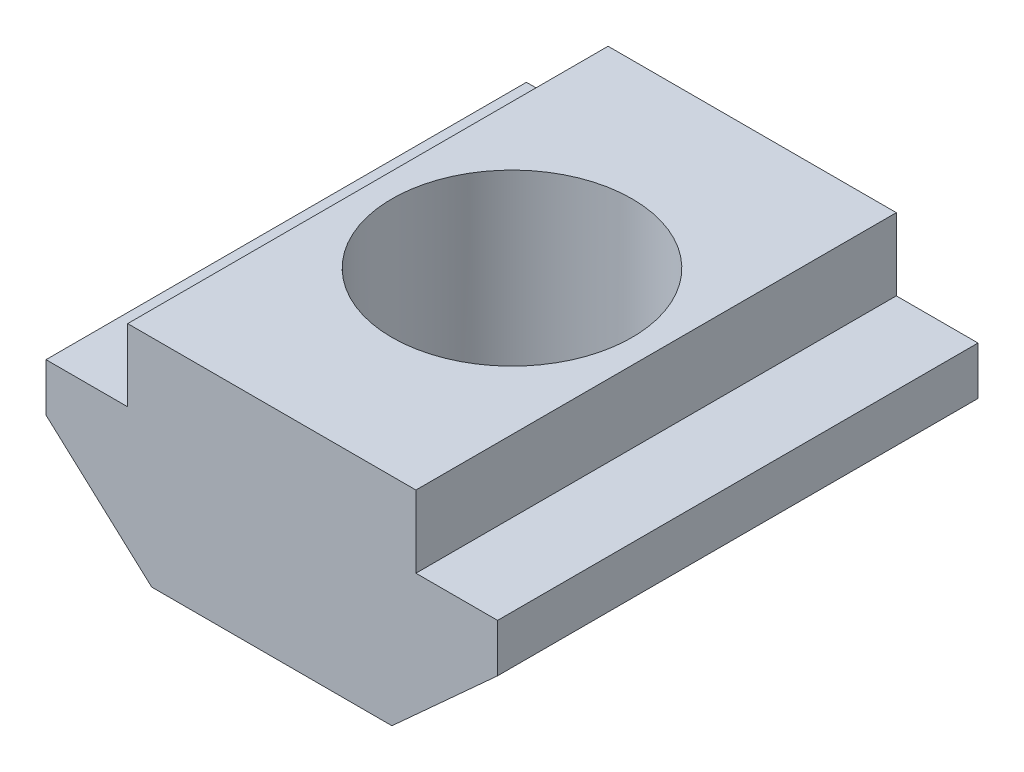
ISO-10303-21;
HEADER;
FILE_DESCRIPTION(('STEP AP214'),'2;1');
FILE_NAME('part.step','',(''),(''),'','','');
FILE_SCHEMA(('AUTOMOTIVE_DESIGN { 1 0 10303 214 1 1 1 1 }'));
ENDSEC;
DATA;
#1=APPLICATION_CONTEXT('core data for automotive mechanical design processes');
#2=APPLICATION_PROTOCOL_DEFINITION('international standard','automotive_design',2000,#1);
#3=PRODUCT_CONTEXT('',#1,'mechanical');
#4=PRODUCT('Part','Part','',(#3));
#5=PRODUCT_RELATED_PRODUCT_CATEGORY('part','',(#4));
#6=PRODUCT_DEFINITION_FORMATION('','',#4);
#7=PRODUCT_DEFINITION_CONTEXT('part definition',#1,'design');
#8=PRODUCT_DEFINITION('design','',#6,#7);
#9=PRODUCT_DEFINITION_SHAPE('','',#8);
#10=(LENGTH_UNIT() NAMED_UNIT(*) SI_UNIT(.MILLI.,.METRE.));
#11=(NAMED_UNIT(*) PLANE_ANGLE_UNIT() SI_UNIT($,.RADIAN.));
#12=(NAMED_UNIT(*) SI_UNIT($,.STERADIAN.) SOLID_ANGLE_UNIT());
#13=UNCERTAINTY_MEASURE_WITH_UNIT(LENGTH_MEASURE(1.E-05),#10,'distance_accuracy_value','');
#14=(GEOMETRIC_REPRESENTATION_CONTEXT(3) GLOBAL_UNCERTAINTY_ASSIGNED_CONTEXT((#13)) GLOBAL_UNIT_ASSIGNED_CONTEXT((#10,
#11,#12)) REPRESENTATION_CONTEXT('',''));
#15=CARTESIAN_POINT('',(0.,0.,0.));
#16=DIRECTION('',(0.,0.,1.));
#17=DIRECTION('',(1.,0.,0.));
#18=AXIS2_PLACEMENT_3D('',#15,#16,#17);
#19=CARTESIAN_POINT('',(-2.5,-4.5,5.));
#20=DIRECTION('',(0.,1.,0.));
#21=DIRECTION('',(0.,0.,1.));
#22=AXIS2_PLACEMENT_3D('',#19,#20,#21);
#23=PLANE('',#22);
#24=DIRECTION('',(0.,0.,-1.));
#25=VECTOR('',#24,1.);
#26=CARTESIAN_POINT('',(2.5,-4.5,5.));
#27=LINE('',#26,#25);
#28=CARTESIAN_POINT('',(2.5,-4.5,0.));
#29=VERTEX_POINT('',#28);
#30=CARTESIAN_POINT('',(2.5,-4.5,-5.));
#31=VERTEX_POINT('',#30);
#32=EDGE_CURVE('E205',#29,#31,#27,.T.);
#33=ORIENTED_EDGE('',*,*,#32,.F.);
#34=CARTESIAN_POINT('',(0.,-4.5,0.));
#35=DIRECTION('',(0.,1.,0.));
#36=DIRECTION('',(0.,0.,1.));
#37=AXIS2_PLACEMENT_3D('',#34,#35,#36);
#38=CIRCLE('',#37,2.5);
#39=CARTESIAN_POINT('',(-2.5,-4.5,0.));
#40=VERTEX_POINT('',#39);
#41=EDGE_CURVE('E53',#29,#40,#38,.T.);
#42=ORIENTED_EDGE('',*,*,#41,.T.);
#43=DIRECTION('',(0.,0.,-1.));
#44=VECTOR('',#43,1.);
#45=CARTESIAN_POINT('',(-2.5,-4.5,5.));
#46=LINE('',#45,#44);
#47=CARTESIAN_POINT('',(-2.5,-4.5,-5.));
#48=VERTEX_POINT('',#47);
#49=EDGE_CURVE('E210',#40,#48,#46,.T.);
#50=ORIENTED_EDGE('',*,*,#49,.T.);
#51=DIRECTION('',(1.,0.,0.));
#52=VECTOR('',#51,1.);
#53=CARTESIAN_POINT('',(-2.5,-4.5,-5.));
#54=LINE('',#53,#52);
#55=EDGE_CURVE('E177',#48,#31,#54,.T.);
#56=ORIENTED_EDGE('',*,*,#55,.T.);
#57=EDGE_LOOP('',(#33,#42,#50,#56));
#58=FACE_BOUND('',#57,.T.);
#59=ADVANCED_FACE('F38',(#58),#23,.F.);
#60=CARTESIAN_POINT('',(-3.,0.,5.));
#61=DIRECTION('',(1.,0.,0.));
#62=DIRECTION('',(0.,1.,0.));
#63=AXIS2_PLACEMENT_3D('',#60,#61,#62);
#64=PLANE('',#63);
#65=DIRECTION('',(0.,-1.,0.));
#66=VECTOR('',#65,1.);
#67=CARTESIAN_POINT('',(-3.,0.,-5.));
#68=LINE('',#67,#66);
#69=CARTESIAN_POINT('',(-3.,0.,-5.));
#70=VERTEX_POINT('',#69);
#71=CARTESIAN_POINT('',(-3.,-1.5,-5.));
#72=VERTEX_POINT('',#71);
#73=EDGE_CURVE('E163',#70,#72,#68,.T.);
#74=ORIENTED_EDGE('',*,*,#73,.T.);
#75=DIRECTION('',(0.,0.,-1.));
#76=VECTOR('',#75,1.);
#77=CARTESIAN_POINT('',(-3.,-1.5,5.));
#78=LINE('',#77,#76);
#79=CARTESIAN_POINT('',(-3.,-1.5,5.));
#80=VERTEX_POINT('',#79);
#81=EDGE_CURVE('E11',#80,#72,#78,.T.);
#82=ORIENTED_EDGE('',*,*,#81,.F.);
#83=DIRECTION('',(0.,-1.,0.));
#84=VECTOR('',#83,1.);
#85=CARTESIAN_POINT('',(-3.,0.,5.));
#86=LINE('',#85,#84);
#87=CARTESIAN_POINT('',(-3.,0.,5.));
#88=VERTEX_POINT('',#87);
#89=EDGE_CURVE('E194',#88,#80,#86,.T.);
#90=ORIENTED_EDGE('',*,*,#89,.F.);
#91=DIRECTION('',(0.,0.,-1.));
#92=VECTOR('',#91,1.);
#93=CARTESIAN_POINT('',(-3.,0.,5.));
#94=LINE('',#93,#92);
#95=EDGE_CURVE('E159',#88,#70,#94,.T.);
#96=ORIENTED_EDGE('',*,*,#95,.T.);
#97=EDGE_LOOP('',(#74,#82,#90,#96));
#98=FACE_BOUND('',#97,.T.);
#99=ADVANCED_FACE('F40',(#98),#64,.F.);
#100=CARTESIAN_POINT('',(-3.,-1.5,5.));
#101=DIRECTION('',(0.,-1.,0.));
#102=DIRECTION('',(1.,0.,0.));
#103=AXIS2_PLACEMENT_3D('',#100,#101,#102);
#104=PLANE('',#103);
#105=DIRECTION('',(-1.,0.,0.));
#106=VECTOR('',#105,1.);
#107=CARTESIAN_POINT('',(-3.,-1.5,-5.));
#108=LINE('',#107,#106);
#109=CARTESIAN_POINT('',(-4.7,-1.5,-5.));
#110=VERTEX_POINT('',#109);
#111=EDGE_CURVE('E167',#72,#110,#108,.T.);
#112=ORIENTED_EDGE('',*,*,#111,.T.);
#113=DIRECTION('',(0.,0.,-1.));
#114=VECTOR('',#113,1.);
#115=CARTESIAN_POINT('',(-4.7,-1.5,5.));
#116=LINE('',#115,#114);
#117=CARTESIAN_POINT('',(-4.7,-1.5,5.));
#118=VERTEX_POINT('',#117);
#119=EDGE_CURVE('E47',#118,#110,#116,.T.);
#120=ORIENTED_EDGE('',*,*,#119,.F.);
#121=DIRECTION('',(-1.,0.,0.));
#122=VECTOR('',#121,1.);
#123=CARTESIAN_POINT('',(-3.,-1.5,5.));
#124=LINE('',#123,#122);
#125=EDGE_CURVE('E109',#80,#118,#124,.T.);
#126=ORIENTED_EDGE('',*,*,#125,.F.);
#127=ORIENTED_EDGE('',*,*,#81,.T.);
#128=EDGE_LOOP('',(#112,#120,#126,#127));
#129=FACE_BOUND('',#128,.T.);
#130=ADVANCED_FACE('F279',(#129),#104,.F.);
#131=CARTESIAN_POINT('',(-4.7,-1.5,5.));
#132=DIRECTION('',(1.,0.,0.));
#133=DIRECTION('',(0.,1.,0.));
#134=AXIS2_PLACEMENT_3D('',#131,#132,#133);
#135=PLANE('',#134);
#136=DIRECTION('',(0.,-1.,0.));
#137=VECTOR('',#136,1.);
#138=CARTESIAN_POINT('',(-4.7,-1.5,-5.));
#139=LINE('',#138,#137);
#140=CARTESIAN_POINT('',(-4.7,-2.5,-5.));
#141=VERTEX_POINT('',#140);
#142=EDGE_CURVE('E170',#110,#141,#139,.T.);
#143=ORIENTED_EDGE('',*,*,#142,.T.);
#144=DIRECTION('',(0.,0.,-1.));
#145=VECTOR('',#144,1.);
#146=CARTESIAN_POINT('',(-4.7,-2.5,5.));
#147=LINE('',#146,#145);
#148=CARTESIAN_POINT('',(-4.7,-2.5,5.));
#149=VERTEX_POINT('',#148);
#150=EDGE_CURVE('E215',#149,#141,#147,.T.);
#151=ORIENTED_EDGE('',*,*,#150,.F.);
#152=DIRECTION('',(0.,-1.,0.));
#153=VECTOR('',#152,1.);
#154=CARTESIAN_POINT('',(-4.7,-1.5,5.));
#155=LINE('',#154,#153);
#156=EDGE_CURVE('E225',#118,#149,#155,.T.);
#157=ORIENTED_EDGE('',*,*,#156,.F.);
#158=ORIENTED_EDGE('',*,*,#119,.T.);
#159=EDGE_LOOP('',(#143,#151,#157,#158));
#160=FACE_BOUND('',#159,.T.);
#161=ADVANCED_FACE('F223',(#160),#135,.F.);
#162=CARTESIAN_POINT('',(-4.7,-2.5,5.));
#163=DIRECTION('',(0.672672793996312,0.739940073395944,0.));
#164=DIRECTION('',(-0.739940073395944,0.672672793996312,0.));
#165=AXIS2_PLACEMENT_3D('',#162,#163,#164);
#166=PLANE('',#165);
#167=DIRECTION('',(0.739940073395944,-0.672672793996312,0.));
#168=VECTOR('',#167,1.);
#169=CARTESIAN_POINT('',(-4.7,-2.5,-5.));
#170=LINE('',#169,#168);
#171=EDGE_CURVE('E173',#141,#48,#170,.T.);
#172=ORIENTED_EDGE('',*,*,#171,.T.);
#173=ORIENTED_EDGE('',*,*,#49,.F.);
#174=CARTESIAN_POINT('',(-2.5,-4.5,5.));
#175=VERTEX_POINT('',#174);
#176=EDGE_CURVE('E211',#175,#40,#46,.T.);
#177=ORIENTED_EDGE('',*,*,#176,.F.);
#178=DIRECTION('',(0.739940073395944,-0.672672793996312,0.));
#179=VECTOR('',#178,1.);
#180=CARTESIAN_POINT('',(-4.7,-2.5,5.));
#181=LINE('',#180,#179);
#182=EDGE_CURVE('E237',#149,#175,#181,.T.);
#183=ORIENTED_EDGE('',*,*,#182,.F.);
#184=ORIENTED_EDGE('',*,*,#150,.T.);
#185=EDGE_LOOP('',(#172,#173,#177,#183,#184));
#186=FACE_BOUND('',#185,.T.);
#187=ADVANCED_FACE('F234',(#186),#166,.F.);
#188=ORIENTED_EDGE('',*,*,#176,.T.);
#189=EDGE_CURVE('E250',#40,#29,#38,.T.);
#190=ORIENTED_EDGE('',*,*,#189,.T.);
#191=CARTESIAN_POINT('',(2.5,-4.5,5.));
#192=VERTEX_POINT('',#191);
#193=EDGE_CURVE('E206',#192,#29,#27,.T.);
#194=ORIENTED_EDGE('',*,*,#193,.F.);
#195=DIRECTION('',(1.,0.,0.));
#196=VECTOR('',#195,1.);
#197=CARTESIAN_POINT('',(-2.5,-4.5,5.));
#198=LINE('',#197,#196);
#199=EDGE_CURVE('E239',#175,#192,#198,.T.);
#200=ORIENTED_EDGE('',*,*,#199,.F.);
#201=EDGE_LOOP('',(#188,#190,#194,#200));
#202=FACE_BOUND('',#201,.T.);
#203=ADVANCED_FACE('F267',(#202),#23,.F.);
#204=CARTESIAN_POINT('',(4.7,-2.5,5.));
#205=DIRECTION('',(-0.672672793996312,0.739940073395944,0.));
#206=DIRECTION('',(-0.739940073395944,-0.672672793996312,0.));
#207=AXIS2_PLACEMENT_3D('',#204,#205,#206);
#208=PLANE('',#207);
#209=DIRECTION('',(0.739940073395944,0.672672793996312,0.));
#210=VECTOR('',#209,1.);
#211=CARTESIAN_POINT('',(4.7,-2.5,-5.));
#212=LINE('',#211,#210);
#213=CARTESIAN_POINT('',(4.7,-2.5,-5.));
#214=VERTEX_POINT('',#213);
#215=EDGE_CURVE('E181',#31,#214,#212,.T.);
#216=ORIENTED_EDGE('',*,*,#215,.T.);
#217=DIRECTION('',(0.,0.,-1.));
#218=VECTOR('',#217,1.);
#219=CARTESIAN_POINT('',(4.7,-2.5,5.));
#220=LINE('',#219,#218);
#221=CARTESIAN_POINT('',(4.7,-2.5,5.));
#222=VERTEX_POINT('',#221);
#223=EDGE_CURVE('E201',#222,#214,#220,.T.);
#224=ORIENTED_EDGE('',*,*,#223,.F.);
#225=DIRECTION('',(0.739940073395944,0.672672793996312,0.));
#226=VECTOR('',#225,1.);
#227=CARTESIAN_POINT('',(4.7,-2.5,5.));
#228=LINE('',#227,#226);
#229=EDGE_CURVE('E242',#192,#222,#228,.T.);
#230=ORIENTED_EDGE('',*,*,#229,.F.);
#231=ORIENTED_EDGE('',*,*,#193,.T.);
#232=ORIENTED_EDGE('',*,*,#32,.T.);
#233=EDGE_LOOP('',(#216,#224,#230,#231,#232));
#234=FACE_BOUND('',#233,.T.);
#235=ADVANCED_FACE('F271',(#234),#208,.F.);
#236=CARTESIAN_POINT('',(4.7,-1.5,5.));
#237=DIRECTION('',(-1.,0.,0.));
#238=DIRECTION('',(0.,-1.,0.));
#239=AXIS2_PLACEMENT_3D('',#236,#237,#238);
#240=PLANE('',#239);
#241=DIRECTION('',(0.,1.,0.));
#242=VECTOR('',#241,1.);
#243=CARTESIAN_POINT('',(4.7,-1.5,-5.));
#244=LINE('',#243,#242);
#245=CARTESIAN_POINT('',(4.7,-1.5,-5.));
#246=VERTEX_POINT('',#245);
#247=EDGE_CURVE('E184',#214,#246,#244,.T.);
#248=ORIENTED_EDGE('',*,*,#247,.T.);
#249=DIRECTION('',(0.,0.,-1.));
#250=VECTOR('',#249,1.);
#251=CARTESIAN_POINT('',(4.7,-1.5,5.));
#252=LINE('',#251,#250);
#253=CARTESIAN_POINT('',(4.7,-1.5,5.));
#254=VERTEX_POINT('',#253);
#255=EDGE_CURVE('E150',#254,#246,#252,.T.);
#256=ORIENTED_EDGE('',*,*,#255,.F.);
#257=DIRECTION('',(0.,1.,0.));
#258=VECTOR('',#257,1.);
#259=CARTESIAN_POINT('',(4.7,-1.5,5.));
#260=LINE('',#259,#258);
#261=EDGE_CURVE('E136',#222,#254,#260,.T.);
#262=ORIENTED_EDGE('',*,*,#261,.F.);
#263=ORIENTED_EDGE('',*,*,#223,.T.);
#264=EDGE_LOOP('',(#248,#256,#262,#263));
#265=FACE_BOUND('',#264,.T.);
#266=ADVANCED_FACE('F274',(#265),#240,.F.);
#267=CARTESIAN_POINT('',(3.,-1.5,5.));
#268=DIRECTION('',(0.,-1.,0.));
#269=DIRECTION('',(1.,0.,0.));
#270=AXIS2_PLACEMENT_3D('',#267,#268,#269);
#271=PLANE('',#270);
#272=DIRECTION('',(-1.,0.,0.));
#273=VECTOR('',#272,1.);
#274=CARTESIAN_POINT('',(3.,-1.5,-5.));
#275=LINE('',#274,#273);
#276=CARTESIAN_POINT('',(3.,-1.5,-5.));
#277=VERTEX_POINT('',#276);
#278=EDGE_CURVE('E146',#246,#277,#275,.T.);
#279=ORIENTED_EDGE('',*,*,#278,.T.);
#280=DIRECTION('',(0.,0.,-1.));
#281=VECTOR('',#280,1.);
#282=CARTESIAN_POINT('',(3.,-1.5,5.));
#283=LINE('',#282,#281);
#284=CARTESIAN_POINT('',(3.,-1.5,5.));
#285=VERTEX_POINT('',#284);
#286=EDGE_CURVE('E143',#285,#277,#283,.T.);
#287=ORIENTED_EDGE('',*,*,#286,.F.);
#288=DIRECTION('',(-1.,0.,0.));
#289=VECTOR('',#288,1.);
#290=CARTESIAN_POINT('',(3.,-1.5,5.));
#291=LINE('',#290,#289);
#292=EDGE_CURVE('E129',#254,#285,#291,.T.);
#293=ORIENTED_EDGE('',*,*,#292,.F.);
#294=ORIENTED_EDGE('',*,*,#255,.T.);
#295=EDGE_LOOP('',(#279,#287,#293,#294));
#296=FACE_BOUND('',#295,.T.);
#297=ADVANCED_FACE('F144',(#296),#271,.F.);
#298=CARTESIAN_POINT('',(3.,0.,5.));
#299=DIRECTION('',(-1.,0.,0.));
#300=DIRECTION('',(0.,-1.,0.));
#301=AXIS2_PLACEMENT_3D('',#298,#299,#300);
#302=PLANE('',#301);
#303=DIRECTION('',(0.,1.,0.));
#304=VECTOR('',#303,1.);
#305=CARTESIAN_POINT('',(3.,0.,-5.));
#306=LINE('',#305,#304);
#307=CARTESIAN_POINT('',(3.,0.,-5.));
#308=VERTEX_POINT('',#307);
#309=EDGE_CURVE('E189',#277,#308,#306,.T.);
#310=ORIENTED_EDGE('',*,*,#309,.T.);
#311=DIRECTION('',(0.,0.,-1.));
#312=VECTOR('',#311,1.);
#313=CARTESIAN_POINT('',(3.,0.,5.));
#314=LINE('',#313,#312);
#315=CARTESIAN_POINT('',(3.,0.,5.));
#316=VERTEX_POINT('',#315);
#317=EDGE_CURVE('E151',#316,#308,#314,.T.);
#318=ORIENTED_EDGE('',*,*,#317,.F.);
#319=DIRECTION('',(0.,1.,0.));
#320=VECTOR('',#319,1.);
#321=CARTESIAN_POINT('',(3.,0.,5.));
#322=LINE('',#321,#320);
#323=EDGE_CURVE('E133',#285,#316,#322,.T.);
#324=ORIENTED_EDGE('',*,*,#323,.F.);
#325=ORIENTED_EDGE('',*,*,#286,.T.);
#326=EDGE_LOOP('',(#310,#318,#324,#325));
#327=FACE_BOUND('',#326,.T.);
#328=ADVANCED_FACE('F153',(#327),#302,.F.);
#329=CARTESIAN_POINT('',(3.,0.,5.));
#330=DIRECTION('',(0.,-1.,0.));
#331=DIRECTION('',(0.,0.,-1.));
#332=AXIS2_PLACEMENT_3D('',#329,#330,#331);
#333=PLANE('',#332);
#334=CARTESIAN_POINT('',(0.,0.,0.));
#335=DIRECTION('',(0.,1.,0.));
#336=DIRECTION('',(0.,0.,1.));
#337=AXIS2_PLACEMENT_3D('',#334,#335,#336);
#338=CIRCLE('',#337,2.5);
#339=CARTESIAN_POINT('',(0.,0.,2.5));
#340=VERTEX_POINT('',#339);
#341=EDGE_CURVE('E251',#340,#340,#338,.T.);
#342=ORIENTED_EDGE('',*,*,#341,.F.);
#343=EDGE_LOOP('',(#342));
#344=FACE_BOUND('',#343,.T.);
#345=DIRECTION('',(-1.,0.,0.));
#346=VECTOR('',#345,1.);
#347=CARTESIAN_POINT('',(3.,0.,-5.));
#348=LINE('',#347,#346);
#349=EDGE_CURVE('E101',#308,#70,#348,.T.);
#350=ORIENTED_EDGE('',*,*,#349,.T.);
#351=ORIENTED_EDGE('',*,*,#95,.F.);
#352=DIRECTION('',(-1.,0.,0.));
#353=VECTOR('',#352,1.);
#354=CARTESIAN_POINT('',(3.,0.,5.));
#355=LINE('',#354,#353);
#356=EDGE_CURVE('E62',#316,#88,#355,.T.);
#357=ORIENTED_EDGE('',*,*,#356,.F.);
#358=ORIENTED_EDGE('',*,*,#317,.T.);
#359=EDGE_LOOP('',(#350,#351,#357,#358));
#360=FACE_BOUND('',#359,.T.);
#361=ADVANCED_FACE('F275',(#344,#360),#333,.F.);
#362=CARTESIAN_POINT('',(0.,0.,5.));
#363=DIRECTION('',(0.,0.,-1.));
#364=DIRECTION('',(-1.,0.,0.));
#365=AXIS2_PLACEMENT_3D('',#362,#363,#364);
#366=PLANE('',#365);
#367=ORIENTED_EDGE('',*,*,#89,.T.);
#368=ORIENTED_EDGE('',*,*,#125,.T.);
#369=ORIENTED_EDGE('',*,*,#156,.T.);
#370=ORIENTED_EDGE('',*,*,#182,.T.);
#371=ORIENTED_EDGE('',*,*,#199,.T.);
#372=ORIENTED_EDGE('',*,*,#229,.T.);
#373=ORIENTED_EDGE('',*,*,#261,.T.);
#374=ORIENTED_EDGE('',*,*,#292,.T.);
#375=ORIENTED_EDGE('',*,*,#323,.T.);
#376=ORIENTED_EDGE('',*,*,#356,.T.);
#377=EDGE_LOOP('',(#367,#368,#369,#370,#371,#372,#373,#374,#375,#376));
#378=FACE_BOUND('',#377,.T.);
#379=ADVANCED_FACE('F131',(#378),#366,.F.);
#380=CARTESIAN_POINT('',(0.,0.,-5.));
#381=DIRECTION('',(0.,0.,-1.));
#382=DIRECTION('',(-1.,0.,0.));
#383=AXIS2_PLACEMENT_3D('',#380,#381,#382);
#384=PLANE('',#383);
#385=ORIENTED_EDGE('',*,*,#73,.F.);
#386=ORIENTED_EDGE('',*,*,#349,.F.);
#387=ORIENTED_EDGE('',*,*,#309,.F.);
#388=ORIENTED_EDGE('',*,*,#278,.F.);
#389=ORIENTED_EDGE('',*,*,#247,.F.);
#390=ORIENTED_EDGE('',*,*,#215,.F.);
#391=ORIENTED_EDGE('',*,*,#55,.F.);
#392=ORIENTED_EDGE('',*,*,#171,.F.);
#393=ORIENTED_EDGE('',*,*,#142,.F.);
#394=ORIENTED_EDGE('',*,*,#111,.F.);
#395=EDGE_LOOP('',(#385,#386,#387,#388,#389,#390,#391,#392,#393,#394));
#396=FACE_BOUND('',#395,.T.);
#397=ADVANCED_FACE('F229',(#396),#384,.T.);
#398=CARTESIAN_POINT('',(0.,-4.5,0.));
#399=DIRECTION('',(0.,1.,0.));
#400=DIRECTION('',(0.,0.,1.));
#401=AXIS2_PLACEMENT_3D('',#398,#399,#400);
#402=CYLINDRICAL_SURFACE('',#401,2.5);
#403=ORIENTED_EDGE('',*,*,#41,.F.);
#404=ORIENTED_EDGE('',*,*,#189,.F.);
#405=EDGE_LOOP('',(#403,#404));
#406=FACE_BOUND('',#405,.T.);
#407=ORIENTED_EDGE('',*,*,#341,.T.);
#408=EDGE_LOOP('',(#407));
#409=FACE_BOUND('',#408,.T.);
#410=ADVANCED_FACE('F263',(#406,#409),#402,.F.);
#411=CLOSED_SHELL('',(#59,#99,#130,#161,#187,#203,#235,#266,#297,#328,#361,#379,#397,#410));
#412=MANIFOLD_SOLID_BREP('B2',#411);
#413=ADVANCED_BREP_SHAPE_REPRESENTATION('',(#18,#412),#14);
#414=SHAPE_DEFINITION_REPRESENTATION(#9,#413);
ENDSEC;
END-ISO-10303-21;
